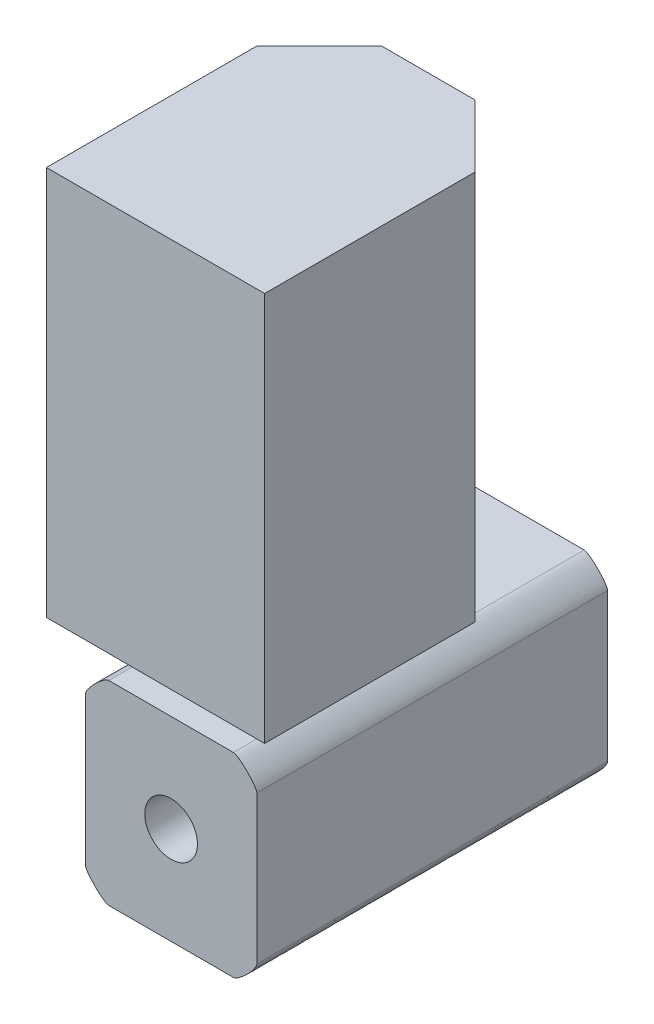
ISO-10303-21;
HEADER;
FILE_DESCRIPTION(('STEP AP214'),'2;1');
FILE_NAME('part.step','',(''),(''),'','','');
FILE_SCHEMA(('AUTOMOTIVE_DESIGN { 1 0 10303 214 1 1 1 1 }'));
ENDSEC;
DATA;
#1=APPLICATION_CONTEXT('core data for automotive mechanical design processes');
#2=APPLICATION_PROTOCOL_DEFINITION('international standard','automotive_design',2000,#1);
#3=PRODUCT_CONTEXT('',#1,'mechanical');
#4=PRODUCT('Part','Part','',(#3));
#5=PRODUCT_RELATED_PRODUCT_CATEGORY('part','',(#4));
#6=PRODUCT_DEFINITION_FORMATION('','',#4);
#7=PRODUCT_DEFINITION_CONTEXT('part definition',#1,'design');
#8=PRODUCT_DEFINITION('design','',#6,#7);
#9=PRODUCT_DEFINITION_SHAPE('','',#8);
#10=(LENGTH_UNIT() NAMED_UNIT(*) SI_UNIT(.MILLI.,.METRE.));
#11=(NAMED_UNIT(*) PLANE_ANGLE_UNIT() SI_UNIT($,.RADIAN.));
#12=(NAMED_UNIT(*) SI_UNIT($,.STERADIAN.) SOLID_ANGLE_UNIT());
#13=UNCERTAINTY_MEASURE_WITH_UNIT(LENGTH_MEASURE(1.E-05),#10,'distance_accuracy_value','');
#14=(GEOMETRIC_REPRESENTATION_CONTEXT(3) GLOBAL_UNCERTAINTY_ASSIGNED_CONTEXT((#13)) GLOBAL_UNIT_ASSIGNED_CONTEXT((#10,
#11,#12)) REPRESENTATION_CONTEXT('',''));
#15=CARTESIAN_POINT('',(0.,0.,0.));
#16=DIRECTION('',(0.,0.,1.));
#17=DIRECTION('',(1.,0.,0.));
#18=AXIS2_PLACEMENT_3D('',#15,#16,#17);
#19=CARTESIAN_POINT('',(-88.8214874697385,29.1570616468552,45.));
#20=DIRECTION('',(0.,1.,0.));
#21=DIRECTION('',(0.,0.,1.));
#22=AXIS2_PLACEMENT_3D('',#19,#20,#21);
#23=PLANE('',#22);
#24=DIRECTION('',(-0.866025403784439,0.,0.5));
#25=VECTOR('',#24,1.);
#26=CARTESIAN_POINT('',(-77.8214874697385,29.1570616468552,13.8397459621556));
#27=LINE('',#26,#25);
#28=CARTESIAN_POINT('',(-77.8214874697385,29.1570616468552,13.8397459621556));
#29=VERTEX_POINT('',#28);
#30=CARTESIAN_POINT('',(-85.3214874697385,29.1570616468552,18.1698729810778));
#31=VERTEX_POINT('',#30);
#32=EDGE_CURVE('E200',#29,#31,#27,.T.);
#33=ORIENTED_EDGE('',*,*,#32,.F.);
#34=DIRECTION('',(-0.866025403784439,0.,-0.5));
#35=VECTOR('',#34,1.);
#36=CARTESIAN_POINT('',(-70.3214874697385,29.1570616468552,18.1698729810778));
#37=LINE('',#36,#35);
#38=CARTESIAN_POINT('',(-70.3214874697385,29.1570616468552,18.1698729810778));
#39=VERTEX_POINT('',#38);
#40=EDGE_CURVE('E252',#39,#29,#37,.T.);
#41=ORIENTED_EDGE('',*,*,#40,.F.);
#42=DIRECTION('',(0.,0.,-1.));
#43=VECTOR('',#42,1.);
#44=CARTESIAN_POINT('',(-70.3214874697385,29.1570616468552,26.8301270189222));
#45=LINE('',#44,#43);
#46=CARTESIAN_POINT('',(-70.3214874697385,29.1570616468552,26.8301270189222));
#47=VERTEX_POINT('',#46);
#48=EDGE_CURVE('E279',#47,#39,#45,.T.);
#49=ORIENTED_EDGE('',*,*,#48,.F.);
#50=DIRECTION('',(0.866025403784438,0.,-0.5));
#51=VECTOR('',#50,1.);
#52=CARTESIAN_POINT('',(-77.8214874697385,29.1570616468552,31.1602540378444));
#53=LINE('',#52,#51);
#54=CARTESIAN_POINT('',(-77.8214874697385,29.1570616468552,31.1602540378444));
#55=VERTEX_POINT('',#54);
#56=EDGE_CURVE('E276',#55,#47,#53,.T.);
#57=ORIENTED_EDGE('',*,*,#56,.F.);
#58=DIRECTION('',(0.866025403784439,0.,0.5));
#59=VECTOR('',#58,1.);
#60=CARTESIAN_POINT('',(-85.3214874697385,29.1570616468552,26.8301270189222));
#61=LINE('',#60,#59);
#62=CARTESIAN_POINT('',(-85.3214874697385,29.1570616468552,26.8301270189222));
#63=VERTEX_POINT('',#62);
#64=EDGE_CURVE('E273',#63,#55,#61,.T.);
#65=ORIENTED_EDGE('',*,*,#64,.F.);
#66=DIRECTION('',(0.,0.,1.));
#67=VECTOR('',#66,1.);
#68=CARTESIAN_POINT('',(-85.3214874697385,29.1570616468552,18.1698729810778));
#69=LINE('',#68,#67);
#70=EDGE_CURVE('E270',#31,#63,#69,.T.);
#71=ORIENTED_EDGE('',*,*,#70,.F.);
#72=EDGE_LOOP('',(#33,#41,#49,#57,#65,#71));
#73=FACE_BOUND('',#72,.T.);
#74=DIRECTION('',(1.,0.,0.));
#75=VECTOR('',#74,1.);
#76=CARTESIAN_POINT('',(-88.8214874697385,29.1570616468552,0.));
#77=LINE('',#76,#75);
#78=CARTESIAN_POINT('',(-85.8214874697385,29.1570616468552,0.));
#79=VERTEX_POINT('',#78);
#80=CARTESIAN_POINT('',(-69.8214874697385,29.1570616468552,0.));
#81=VERTEX_POINT('',#80);
#82=EDGE_CURVE('E301',#79,#81,#77,.T.);
#83=ORIENTED_EDGE('',*,*,#82,.F.);
#84=CARTESIAN_POINT('',(-85.8214874697385,29.1570616468552,47.25));
#85=CARTESIAN_POINT('',(-85.8214874697385,29.1570616468552,30.75));
#86=CARTESIAN_POINT('',(-85.8214874697385,29.1570616468552,14.25));
#87=CARTESIAN_POINT('',(-85.8214874697385,29.1570616468552,-2.25));
#88=(BOUNDED_CURVE() B_SPLINE_CURVE(3,(#84,#85,#86,#87),.UNSPECIFIED.,.F.,
.F.) B_SPLINE_CURVE_WITH_KNOTS((4,4),(-0.04725,0.00225),
.UNSPECIFIED.) CURVE() GEOMETRIC_REPRESENTATION_ITEM() RATIONAL_B_SPLINE_CURVE((1.,1.,1.,1.)) REPRESENTATION_ITEM(''));
#89=CARTESIAN_POINT('',(-85.8214874697385,29.1570616468552,45.));
#90=VERTEX_POINT('',#89);
#91=EDGE_CURVE('E521',#79,#90,#88,.F.);
#92=ORIENTED_EDGE('',*,*,#91,.T.);
#93=DIRECTION('',(1.,0.,0.));
#94=VECTOR('',#93,1.);
#95=CARTESIAN_POINT('',(-88.8214874697385,29.1570616468552,45.));
#96=LINE('',#95,#94);
#97=CARTESIAN_POINT('',(-69.8214874697385,29.1570616468552,45.));
#98=VERTEX_POINT('',#97);
#99=EDGE_CURVE('E307',#90,#98,#96,.T.);
#100=ORIENTED_EDGE('',*,*,#99,.T.);
#101=CARTESIAN_POINT('',(-69.8214874697385,29.1570616468552,-2.25));
#102=CARTESIAN_POINT('',(-69.8214874697385,29.1570616468552,14.25));
#103=CARTESIAN_POINT('',(-69.8214874697385,29.1570616468552,30.75));
#104=CARTESIAN_POINT('',(-69.8214874697385,29.1570616468552,47.25));
#105=(BOUNDED_CURVE() B_SPLINE_CURVE(3,(#101,#102,#103,#104),.UNSPECIFIED.,.F.,
.F.) B_SPLINE_CURVE_WITH_KNOTS((4,4),(-0.00225,0.04725),
.UNSPECIFIED.) CURVE() GEOMETRIC_REPRESENTATION_ITEM() RATIONAL_B_SPLINE_CURVE((1.,1.,1.,1.)) REPRESENTATION_ITEM(''));
#106=EDGE_CURVE('E373',#98,#81,#105,.F.);
#107=ORIENTED_EDGE('',*,*,#106,.T.);
#108=EDGE_LOOP('',(#83,#92,#100,#107));
#109=FACE_BOUND('',#108,.T.);
#110=ADVANCED_FACE('F44',(#73,#109),#23,.T.);
#111=CARTESIAN_POINT('',(-88.8214874697385,29.1570616468552,45.));
#112=DIRECTION('',(1.,0.,0.));
#113=DIRECTION('',(0.,0.,-1.));
#114=AXIS2_PLACEMENT_3D('',#111,#112,#113);
#115=PLANE('',#114);
#116=DIRECTION('',(0.,-1.,0.));
#117=VECTOR('',#116,1.);
#118=CARTESIAN_POINT('',(-88.8214874697385,29.1570616468552,0.));
#119=LINE('',#118,#117);
#120=CARTESIAN_POINT('',(-88.8214874697385,26.1570616468552,0.));
#121=VERTEX_POINT('',#120);
#122=CARTESIAN_POINT('',(-88.8214874697385,7.15706164685515,0.));
#123=VERTEX_POINT('',#122);
#124=EDGE_CURVE('E312',#121,#123,#119,.T.);
#125=ORIENTED_EDGE('',*,*,#124,.T.);
#126=CARTESIAN_POINT('',(-88.8214874697385,7.15706164685515,47.25));
#127=CARTESIAN_POINT('',(-88.8214874697385,7.15706164685515,30.75));
#128=CARTESIAN_POINT('',(-88.8214874697385,7.15706164685515,14.25));
#129=CARTESIAN_POINT('',(-88.8214874697385,7.15706164685515,-2.25));
#130=(BOUNDED_CURVE() B_SPLINE_CURVE(3,(#126,#127,#128,#129),.UNSPECIFIED.,.F.,
.F.) B_SPLINE_CURVE_WITH_KNOTS((4,4),(-0.00225,0.04725),
.UNSPECIFIED.) CURVE() GEOMETRIC_REPRESENTATION_ITEM() RATIONAL_B_SPLINE_CURVE((1.,1.,1.,1.)) REPRESENTATION_ITEM(''));
#131=CARTESIAN_POINT('',(-88.8214874697385,7.15706164685515,45.));
#132=VERTEX_POINT('',#131);
#133=EDGE_CURVE('E462',#123,#132,#130,.F.);
#134=ORIENTED_EDGE('',*,*,#133,.T.);
#135=DIRECTION('',(0.,-1.,0.));
#136=VECTOR('',#135,1.);
#137=CARTESIAN_POINT('',(-88.8214874697385,29.1570616468552,45.));
#138=LINE('',#137,#136);
#139=CARTESIAN_POINT('',(-88.8214874697385,26.1570616468552,45.));
#140=VERTEX_POINT('',#139);
#141=EDGE_CURVE('E603',#140,#132,#138,.T.);
#142=ORIENTED_EDGE('',*,*,#141,.F.);
#143=CARTESIAN_POINT('',(-88.8214874697385,26.1570616468552,-2.25));
#144=CARTESIAN_POINT('',(-88.8214874697385,26.1570616468552,14.25));
#145=CARTESIAN_POINT('',(-88.8214874697385,26.1570616468552,30.75));
#146=CARTESIAN_POINT('',(-88.8214874697385,26.1570616468552,47.25));
#147=(BOUNDED_CURVE() B_SPLINE_CURVE(3,(#143,#144,#145,#146),.UNSPECIFIED.,.F.,
.F.) B_SPLINE_CURVE_WITH_KNOTS((4,4),(-0.04725,0.00225),
.UNSPECIFIED.) CURVE() GEOMETRIC_REPRESENTATION_ITEM() RATIONAL_B_SPLINE_CURVE((1.,1.,1.,1.)) REPRESENTATION_ITEM(''));
#148=EDGE_CURVE('E661',#140,#121,#147,.F.);
#149=ORIENTED_EDGE('',*,*,#148,.T.);
#150=EDGE_LOOP('',(#125,#134,#142,#149));
#151=FACE_BOUND('',#150,.T.);
#152=ADVANCED_FACE('F389',(#151),#115,.F.);
#153=CARTESIAN_POINT('',(-88.8214874697385,4.15706164685515,45.));
#154=DIRECTION('',(0.,1.,0.));
#155=DIRECTION('',(-1.,0.,0.));
#156=AXIS2_PLACEMENT_3D('',#153,#154,#155);
#157=PLANE('',#156);
#158=DIRECTION('',(1.,0.,0.));
#159=VECTOR('',#158,1.);
#160=CARTESIAN_POINT('',(-88.8214874697385,4.15706164685515,45.));
#161=LINE('',#160,#159);
#162=CARTESIAN_POINT('',(-85.8214874697385,4.15706164685515,45.));
#163=VERTEX_POINT('',#162);
#164=CARTESIAN_POINT('',(-69.8214874697385,4.15706164685515,45.));
#165=VERTEX_POINT('',#164);
#166=EDGE_CURVE('E317',#163,#165,#161,.T.);
#167=ORIENTED_EDGE('',*,*,#166,.F.);
#168=CARTESIAN_POINT('',(-85.8214874697385,4.15706164685515,-2.25));
#169=CARTESIAN_POINT('',(-85.8214874697385,4.15706164685515,14.25));
#170=CARTESIAN_POINT('',(-85.8214874697385,4.15706164685515,30.75));
#171=CARTESIAN_POINT('',(-85.8214874697385,4.15706164685515,47.25));
#172=(BOUNDED_CURVE() B_SPLINE_CURVE(3,(#168,#169,#170,#171),.UNSPECIFIED.,.F.,
.F.) B_SPLINE_CURVE_WITH_KNOTS((4,4),(-0.00225,0.04725),
.UNSPECIFIED.) CURVE() GEOMETRIC_REPRESENTATION_ITEM() RATIONAL_B_SPLINE_CURVE((1.,1.,1.,1.)) REPRESENTATION_ITEM(''));
#173=CARTESIAN_POINT('',(-85.8214874697385,4.15706164685515,0.));
#174=VERTEX_POINT('',#173);
#175=EDGE_CURVE('E443',#163,#174,#172,.F.);
#176=ORIENTED_EDGE('',*,*,#175,.T.);
#177=DIRECTION('',(1.,0.,0.));
#178=VECTOR('',#177,1.);
#179=CARTESIAN_POINT('',(-88.8214874697385,4.15706164685515,0.));
#180=LINE('',#179,#178);
#181=CARTESIAN_POINT('',(-69.8214874697385,4.15706164685515,0.));
#182=VERTEX_POINT('',#181);
#183=EDGE_CURVE('E629',#174,#182,#180,.T.);
#184=ORIENTED_EDGE('',*,*,#183,.T.);
#185=CARTESIAN_POINT('',(-69.8214874697385,4.15706164685515,47.25));
#186=CARTESIAN_POINT('',(-69.8214874697385,4.15706164685515,30.75));
#187=CARTESIAN_POINT('',(-69.8214874697385,4.15706164685515,14.25));
#188=CARTESIAN_POINT('',(-69.8214874697385,4.15706164685515,-2.25));
#189=(BOUNDED_CURVE() B_SPLINE_CURVE(3,(#185,#186,#187,#188),.UNSPECIFIED.,.F.,
.F.) B_SPLINE_CURVE_WITH_KNOTS((4,4),(-0.04725,0.00225),
.UNSPECIFIED.) CURVE() GEOMETRIC_REPRESENTATION_ITEM() RATIONAL_B_SPLINE_CURVE((1.,1.,1.,1.)) REPRESENTATION_ITEM(''));
#190=EDGE_CURVE('E599',#182,#165,#189,.F.);
#191=ORIENTED_EDGE('',*,*,#190,.T.);
#192=EDGE_LOOP('',(#167,#176,#184,#191));
#193=FACE_BOUND('',#192,.T.);
#194=ADVANCED_FACE('F640',(#193),#157,.F.);
#195=CARTESIAN_POINT('',(-66.8214874697385,29.1570616468552,45.));
#196=DIRECTION('',(1.,0.,0.));
#197=DIRECTION('',(0.,0.,-1.));
#198=AXIS2_PLACEMENT_3D('',#195,#196,#197);
#199=PLANE('',#198);
#200=DIRECTION('',(0.,-1.,0.));
#201=VECTOR('',#200,1.);
#202=CARTESIAN_POINT('',(-66.8214874697385,29.1570616468552,0.));
#203=LINE('',#202,#201);
#204=CARTESIAN_POINT('',(-66.8214874697385,26.1570616468552,0.));
#205=VERTEX_POINT('',#204);
#206=CARTESIAN_POINT('',(-66.8214874697385,7.15706164685515,0.));
#207=VERTEX_POINT('',#206);
#208=EDGE_CURVE('E624',#205,#207,#203,.T.);
#209=ORIENTED_EDGE('',*,*,#208,.F.);
#210=CARTESIAN_POINT('',(-66.8214874697385,26.1570616468552,47.25));
#211=CARTESIAN_POINT('',(-66.8214874697385,26.1570616468552,30.75));
#212=CARTESIAN_POINT('',(-66.8214874697385,26.1570616468552,14.25));
#213=CARTESIAN_POINT('',(-66.8214874697385,26.1570616468552,-2.25));
#214=(BOUNDED_CURVE() B_SPLINE_CURVE(3,(#210,#211,#212,#213),.UNSPECIFIED.,.F.,
.F.) B_SPLINE_CURVE_WITH_KNOTS((4,4),(-0.00225,0.04725),
.UNSPECIFIED.) CURVE() GEOMETRIC_REPRESENTATION_ITEM() RATIONAL_B_SPLINE_CURVE((1.,1.,1.,1.)) REPRESENTATION_ITEM(''));
#215=CARTESIAN_POINT('',(-66.8214874697385,26.1570616468552,45.));
#216=VERTEX_POINT('',#215);
#217=EDGE_CURVE('E12',#205,#216,#214,.F.);
#218=ORIENTED_EDGE('',*,*,#217,.T.);
#219=DIRECTION('',(0.,-1.,0.));
#220=VECTOR('',#219,1.);
#221=CARTESIAN_POINT('',(-66.8214874697385,29.1570616468552,45.));
#222=LINE('',#221,#220);
#223=CARTESIAN_POINT('',(-66.8214874697385,7.15706164685515,45.));
#224=VERTEX_POINT('',#223);
#225=EDGE_CURVE('E311',#216,#224,#222,.T.);
#226=ORIENTED_EDGE('',*,*,#225,.T.);
#227=CARTESIAN_POINT('',(-66.8214874697385,7.15706164685515,-2.25));
#228=CARTESIAN_POINT('',(-66.8214874697385,7.15706164685515,14.25));
#229=CARTESIAN_POINT('',(-66.8214874697385,7.15706164685515,30.75));
#230=CARTESIAN_POINT('',(-66.8214874697385,7.15706164685515,47.25));
#231=(BOUNDED_CURVE() B_SPLINE_CURVE(3,(#227,#228,#229,#230),.UNSPECIFIED.,.F.,
.F.) B_SPLINE_CURVE_WITH_KNOTS((4,4),(-0.04725,0.00225),
.UNSPECIFIED.) CURVE() GEOMETRIC_REPRESENTATION_ITEM() RATIONAL_B_SPLINE_CURVE((1.,1.,1.,1.)) REPRESENTATION_ITEM(''));
#232=EDGE_CURVE('E58',#224,#207,#231,.F.);
#233=ORIENTED_EDGE('',*,*,#232,.T.);
#234=EDGE_LOOP('',(#209,#218,#226,#233));
#235=FACE_BOUND('',#234,.T.);
#236=ADVANCED_FACE('F335',(#235),#199,.T.);
#237=CARTESIAN_POINT('',(0.,0.,45.));
#238=DIRECTION('',(0.,0.,-1.));
#239=DIRECTION('',(-1.,0.,0.));
#240=AXIS2_PLACEMENT_3D('',#237,#238,#239);
#241=PLANE('',#240);
#242=CARTESIAN_POINT('',(-77.8214874697385,16.6570616468552,45.));
#243=DIRECTION('',(0.,0.,-1.));
#244=DIRECTION('',(-1.,0.,0.));
#245=AXIS2_PLACEMENT_3D('',#242,#243,#244);
#246=CIRCLE('',#245,3.37819999999998);
#247=CARTESIAN_POINT('',(-81.1996874697385,16.6570616468552,45.));
#248=VERTEX_POINT('',#247);
#249=EDGE_CURVE('E227',#248,#248,#246,.T.);
#250=ORIENTED_EDGE('',*,*,#249,.T.);
#251=EDGE_LOOP('',(#250));
#252=FACE_BOUND('',#251,.T.);
#253=ORIENTED_EDGE('',*,*,#141,.T.);
#254=CARTESIAN_POINT('',(-85.8214874697385,4.15706164685515,45.));
#255=CARTESIAN_POINT('',(-88.8214874697385,4.15706164685516,45.));
#256=CARTESIAN_POINT('',(-88.8214874697385,7.15706164685515,45.));
#257=(BOUNDED_CURVE() B_SPLINE_CURVE(2,(#254,#255,#256),.UNSPECIFIED.,.F.,
.F.) B_SPLINE_CURVE_WITH_KNOTS((3,3),(0.,1.),
.UNSPECIFIED.) CURVE() GEOMETRIC_REPRESENTATION_ITEM() RATIONAL_B_SPLINE_CURVE((1.,
0.212132034355965,1.)) REPRESENTATION_ITEM(''));
#258=EDGE_CURVE('E358',#132,#163,#257,.F.);
#259=ORIENTED_EDGE('',*,*,#258,.T.);
#260=ORIENTED_EDGE('',*,*,#166,.T.);
#261=CARTESIAN_POINT('',(-66.8214874697385,7.15706164685515,45.));
#262=CARTESIAN_POINT('',(-66.8214874697385,4.15706164685515,45.));
#263=CARTESIAN_POINT('',(-69.8214874697385,4.15706164685515,45.));
#264=(BOUNDED_CURVE() B_SPLINE_CURVE(2,(#261,#262,#263),.UNSPECIFIED.,.F.,
.F.) B_SPLINE_CURVE_WITH_KNOTS((3,3),(0.,1.),
.UNSPECIFIED.) CURVE() GEOMETRIC_REPRESENTATION_ITEM() RATIONAL_B_SPLINE_CURVE((1.,
0.212132034355964,1.)) REPRESENTATION_ITEM(''));
#265=EDGE_CURVE('E65',#165,#224,#264,.F.);
#266=ORIENTED_EDGE('',*,*,#265,.T.);
#267=ORIENTED_EDGE('',*,*,#225,.F.);
#268=CARTESIAN_POINT('',(-69.8214874697385,29.1570616468552,45.));
#269=CARTESIAN_POINT('',(-66.8214874697385,29.1570616468552,45.));
#270=CARTESIAN_POINT('',(-66.8214874697385,26.1570616468552,45.));
#271=(BOUNDED_CURVE() B_SPLINE_CURVE(2,(#268,#269,#270),.UNSPECIFIED.,.F.,
.F.) B_SPLINE_CURVE_WITH_KNOTS((3,3),(0.,1.),
.UNSPECIFIED.) CURVE() GEOMETRIC_REPRESENTATION_ITEM() RATIONAL_B_SPLINE_CURVE((1.,
0.212132034355964,1.)) REPRESENTATION_ITEM(''));
#272=EDGE_CURVE('E552',#216,#98,#271,.F.);
#273=ORIENTED_EDGE('',*,*,#272,.T.);
#274=ORIENTED_EDGE('',*,*,#99,.F.);
#275=CARTESIAN_POINT('',(-88.8214874697385,26.1570616468552,45.));
#276=CARTESIAN_POINT('',(-88.8214874697385,29.1570616468551,45.));
#277=CARTESIAN_POINT('',(-85.8214874697385,29.1570616468552,45.));
#278=(BOUNDED_CURVE() B_SPLINE_CURVE(2,(#275,#276,#277),.UNSPECIFIED.,.F.,
.F.) B_SPLINE_CURVE_WITH_KNOTS((3,3),(0.,1.),
.UNSPECIFIED.) CURVE() GEOMETRIC_REPRESENTATION_ITEM() RATIONAL_B_SPLINE_CURVE((1.,
0.212132034355965,1.)) REPRESENTATION_ITEM(''));
#279=EDGE_CURVE('E914',#90,#140,#278,.F.);
#280=ORIENTED_EDGE('',*,*,#279,.T.);
#281=EDGE_LOOP('',(#253,#259,#260,#266,#267,#273,#274,#280));
#282=FACE_BOUND('',#281,.T.);
#283=ADVANCED_FACE('F324',(#252,#282),#241,.F.);
#284=CARTESIAN_POINT('',(0.,0.,0.));
#285=DIRECTION('',(0.,0.,-1.));
#286=DIRECTION('',(-1.,0.,0.));
#287=AXIS2_PLACEMENT_3D('',#284,#285,#286);
#288=PLANE('',#287);
#289=CARTESIAN_POINT('',(-77.8214874697385,16.6570616468552,0.));
#290=DIRECTION('',(0.,0.,-1.));
#291=DIRECTION('',(-1.,0.,0.));
#292=AXIS2_PLACEMENT_3D('',#289,#290,#291);
#293=CIRCLE('',#292,4.01319999999999);
#294=CARTESIAN_POINT('',(-81.8346874697385,16.6570616468552,0.));
#295=VERTEX_POINT('',#294);
#296=EDGE_CURVE('E892',#295,#295,#293,.T.);
#297=ORIENTED_EDGE('',*,*,#296,.F.);
#298=EDGE_LOOP('',(#297));
#299=FACE_BOUND('',#298,.T.);
#300=ORIENTED_EDGE('',*,*,#183,.F.);
#301=CARTESIAN_POINT('',(-88.8214874697385,7.15706164685515,0.));
#302=CARTESIAN_POINT('',(-88.8214874697385,4.15706164685516,0.));
#303=CARTESIAN_POINT('',(-85.8214874697385,4.15706164685515,0.));
#304=(BOUNDED_CURVE() B_SPLINE_CURVE(2,(#301,#302,#303),.UNSPECIFIED.,.F.,
.F.) B_SPLINE_CURVE_WITH_KNOTS((3,3),(0.,1.),
.UNSPECIFIED.) CURVE() GEOMETRIC_REPRESENTATION_ITEM() RATIONAL_B_SPLINE_CURVE((1.,
0.212132034355965,1.)) REPRESENTATION_ITEM(''));
#305=EDGE_CURVE('E432',#174,#123,#304,.F.);
#306=ORIENTED_EDGE('',*,*,#305,.T.);
#307=ORIENTED_EDGE('',*,*,#124,.F.);
#308=CARTESIAN_POINT('',(-85.8214874697385,29.1570616468552,0.));
#309=CARTESIAN_POINT('',(-88.8214874697385,29.1570616468551,0.));
#310=CARTESIAN_POINT('',(-88.8214874697385,26.1570616468552,0.));
#311=(BOUNDED_CURVE() B_SPLINE_CURVE(2,(#308,#309,#310),.UNSPECIFIED.,.F.,
.F.) B_SPLINE_CURVE_WITH_KNOTS((3,3),(0.,1.),
.UNSPECIFIED.) CURVE() GEOMETRIC_REPRESENTATION_ITEM() RATIONAL_B_SPLINE_CURVE((1.,
0.212132034355965,1.)) REPRESENTATION_ITEM(''));
#312=EDGE_CURVE('E475',#121,#79,#311,.F.);
#313=ORIENTED_EDGE('',*,*,#312,.T.);
#314=ORIENTED_EDGE('',*,*,#82,.T.);
#315=CARTESIAN_POINT('',(-66.8214874697385,26.1570616468552,0.));
#316=CARTESIAN_POINT('',(-66.8214874697385,29.1570616468552,0.));
#317=CARTESIAN_POINT('',(-69.8214874697385,29.1570616468552,0.));
#318=(BOUNDED_CURVE() B_SPLINE_CURVE(2,(#315,#316,#317),.UNSPECIFIED.,.F.,
.F.) B_SPLINE_CURVE_WITH_KNOTS((3,3),(0.,1.),
.UNSPECIFIED.) CURVE() GEOMETRIC_REPRESENTATION_ITEM() RATIONAL_B_SPLINE_CURVE((1.,
0.212132034355964,1.)) REPRESENTATION_ITEM(''));
#319=EDGE_CURVE('E532',#81,#205,#318,.F.);
#320=ORIENTED_EDGE('',*,*,#319,.T.);
#321=ORIENTED_EDGE('',*,*,#208,.T.);
#322=CARTESIAN_POINT('',(-69.8214874697385,4.15706164685515,0.));
#323=CARTESIAN_POINT('',(-66.8214874697385,4.15706164685515,0.));
#324=CARTESIAN_POINT('',(-66.8214874697385,7.15706164685515,0.));
#325=(BOUNDED_CURVE() B_SPLINE_CURVE(2,(#322,#323,#324),.UNSPECIFIED.,.F.,
.F.) B_SPLINE_CURVE_WITH_KNOTS((3,3),(0.,1.),
.UNSPECIFIED.) CURVE() GEOMETRIC_REPRESENTATION_ITEM() RATIONAL_B_SPLINE_CURVE((1.,
0.212132034355964,1.)) REPRESENTATION_ITEM(''));
#326=EDGE_CURVE('E573',#207,#182,#325,.F.);
#327=ORIENTED_EDGE('',*,*,#326,.T.);
#328=EDGE_LOOP('',(#300,#306,#307,#313,#314,#320,#321,#327));
#329=FACE_BOUND('',#328,.T.);
#330=ADVANCED_FACE('F334',(#299,#329),#288,.T.);
#331=CARTESIAN_POINT('',(-77.8214874697385,34.1570616468551,13.8397459621556));
#332=DIRECTION('',(0.5,0.,0.866025403784439));
#333=DIRECTION('',(0.866025403784439,0.,-0.5));
#334=AXIS2_PLACEMENT_3D('',#331,#332,#333);
#335=PLANE('',#334);
#336=ORIENTED_EDGE('',*,*,#32,.T.);
#337=DIRECTION('',(0.,-1.,0.));
#338=VECTOR('',#337,1.);
#339=CARTESIAN_POINT('',(-85.3214874697385,34.1570616468551,18.1698729810778));
#340=LINE('',#339,#338);
#341=CARTESIAN_POINT('',(-85.3214874697385,34.1570616468551,18.1698729810778));
#342=VERTEX_POINT('',#341);
#343=EDGE_CURVE('E298',#342,#31,#340,.T.);
#344=ORIENTED_EDGE('',*,*,#343,.F.);
#345=DIRECTION('',(-0.866025403784439,0.,0.5));
#346=VECTOR('',#345,1.);
#347=CARTESIAN_POINT('',(-77.8214874697385,34.1570616468551,13.8397459621556));
#348=LINE('',#347,#346);
#349=CARTESIAN_POINT('',(-77.8214874697385,34.1570616468551,13.8397459621556));
#350=VERTEX_POINT('',#349);
#351=EDGE_CURVE('E248',#350,#342,#348,.T.);
#352=ORIENTED_EDGE('',*,*,#351,.F.);
#353=DIRECTION('',(0.,-1.,0.));
#354=VECTOR('',#353,1.);
#355=CARTESIAN_POINT('',(-77.8214874697385,34.1570616468551,13.8397459621556));
#356=LINE('',#355,#354);
#357=EDGE_CURVE('E267',#350,#29,#356,.T.);
#358=ORIENTED_EDGE('',*,*,#357,.T.);
#359=EDGE_LOOP('',(#336,#344,#352,#358));
#360=FACE_BOUND('',#359,.T.);
#361=ADVANCED_FACE('F337',(#360),#335,.F.);
#362=CARTESIAN_POINT('',(-85.3214874697385,34.1570616468551,18.1698729810778));
#363=DIRECTION('',(1.,0.,0.));
#364=DIRECTION('',(0.,0.,-1.));
#365=AXIS2_PLACEMENT_3D('',#362,#363,#364);
#366=PLANE('',#365);
#367=ORIENTED_EDGE('',*,*,#70,.T.);
#368=DIRECTION('',(0.,-1.,0.));
#369=VECTOR('',#368,1.);
#370=CARTESIAN_POINT('',(-85.3214874697385,34.1570616468551,26.8301270189222));
#371=LINE('',#370,#369);
#372=CARTESIAN_POINT('',(-85.3214874697385,34.1570616468551,26.8301270189222));
#373=VERTEX_POINT('',#372);
#374=EDGE_CURVE('E295',#373,#63,#371,.T.);
#375=ORIENTED_EDGE('',*,*,#374,.F.);
#376=DIRECTION('',(0.,0.,1.));
#377=VECTOR('',#376,1.);
#378=CARTESIAN_POINT('',(-85.3214874697385,34.1570616468551,18.1698729810778));
#379=LINE('',#378,#377);
#380=EDGE_CURVE('E251',#342,#373,#379,.T.);
#381=ORIENTED_EDGE('',*,*,#380,.F.);
#382=ORIENTED_EDGE('',*,*,#343,.T.);
#383=EDGE_LOOP('',(#367,#375,#381,#382));
#384=FACE_BOUND('',#383,.T.);
#385=ADVANCED_FACE('F688',(#384),#366,.F.);
#386=CARTESIAN_POINT('',(-85.3214874697385,34.1570616468551,26.8301270189222));
#387=DIRECTION('',(0.5,0.,-0.866025403784439));
#388=DIRECTION('',(-0.866025403784439,0.,-0.5));
#389=AXIS2_PLACEMENT_3D('',#386,#387,#388);
#390=PLANE('',#389);
#391=ORIENTED_EDGE('',*,*,#64,.T.);
#392=DIRECTION('',(0.,-1.,0.));
#393=VECTOR('',#392,1.);
#394=CARTESIAN_POINT('',(-77.8214874697385,34.1570616468551,31.1602540378444));
#395=LINE('',#394,#393);
#396=CARTESIAN_POINT('',(-77.8214874697385,34.1570616468551,31.1602540378444));
#397=VERTEX_POINT('',#396);
#398=EDGE_CURVE('E292',#397,#55,#395,.T.);
#399=ORIENTED_EDGE('',*,*,#398,.F.);
#400=DIRECTION('',(0.866025403784439,0.,0.5));
#401=VECTOR('',#400,1.);
#402=CARTESIAN_POINT('',(-85.3214874697385,34.1570616468551,26.8301270189222));
#403=LINE('',#402,#401);
#404=EDGE_CURVE('E255',#373,#397,#403,.T.);
#405=ORIENTED_EDGE('',*,*,#404,.F.);
#406=ORIENTED_EDGE('',*,*,#374,.T.);
#407=EDGE_LOOP('',(#391,#399,#405,#406));
#408=FACE_BOUND('',#407,.T.);
#409=ADVANCED_FACE('F695',(#408),#390,.F.);
#410=CARTESIAN_POINT('',(-77.8214874697385,34.1570616468551,31.1602540378444));
#411=DIRECTION('',(-0.5,0.,-0.866025403784439));
#412=DIRECTION('',(-0.866025403784439,0.,0.5));
#413=AXIS2_PLACEMENT_3D('',#410,#411,#412);
#414=PLANE('',#413);
#415=ORIENTED_EDGE('',*,*,#56,.T.);
#416=DIRECTION('',(0.,-1.,0.));
#417=VECTOR('',#416,1.);
#418=CARTESIAN_POINT('',(-70.3214874697385,34.1570616468551,26.8301270189222));
#419=LINE('',#418,#417);
#420=CARTESIAN_POINT('',(-70.3214874697385,34.1570616468551,26.8301270189222));
#421=VERTEX_POINT('',#420);
#422=EDGE_CURVE('E289',#421,#47,#419,.T.);
#423=ORIENTED_EDGE('',*,*,#422,.F.);
#424=DIRECTION('',(0.866025403784438,0.,-0.5));
#425=VECTOR('',#424,1.);
#426=CARTESIAN_POINT('',(-77.8214874697385,34.1570616468551,31.1602540378444));
#427=LINE('',#426,#425);
#428=EDGE_CURVE('E258',#397,#421,#427,.T.);
#429=ORIENTED_EDGE('',*,*,#428,.F.);
#430=ORIENTED_EDGE('',*,*,#398,.T.);
#431=EDGE_LOOP('',(#415,#423,#429,#430));
#432=FACE_BOUND('',#431,.T.);
#433=ADVANCED_FACE('F702',(#432),#414,.F.);
#434=CARTESIAN_POINT('',(-70.3214874697385,34.1570616468551,26.8301270189222));
#435=DIRECTION('',(-1.,0.,0.));
#436=DIRECTION('',(0.,0.,1.));
#437=AXIS2_PLACEMENT_3D('',#434,#435,#436);
#438=PLANE('',#437);
#439=ORIENTED_EDGE('',*,*,#48,.T.);
#440=DIRECTION('',(0.,-1.,0.));
#441=VECTOR('',#440,1.);
#442=CARTESIAN_POINT('',(-70.3214874697385,34.1570616468551,18.1698729810778));
#443=LINE('',#442,#441);
#444=CARTESIAN_POINT('',(-70.3214874697385,34.1570616468551,18.1698729810778));
#445=VERTEX_POINT('',#444);
#446=EDGE_CURVE('E286',#445,#39,#443,.T.);
#447=ORIENTED_EDGE('',*,*,#446,.F.);
#448=DIRECTION('',(0.,0.,-1.));
#449=VECTOR('',#448,1.);
#450=CARTESIAN_POINT('',(-70.3214874697385,34.1570616468551,26.8301270189222));
#451=LINE('',#450,#449);
#452=EDGE_CURVE('E261',#421,#445,#451,.T.);
#453=ORIENTED_EDGE('',*,*,#452,.F.);
#454=ORIENTED_EDGE('',*,*,#422,.T.);
#455=EDGE_LOOP('',(#439,#447,#453,#454));
#456=FACE_BOUND('',#455,.T.);
#457=ADVANCED_FACE('F710',(#456),#438,.F.);
#458=CARTESIAN_POINT('',(-70.3214874697385,34.1570616468551,18.1698729810778));
#459=DIRECTION('',(-0.5,0.,0.866025403784439));
#460=DIRECTION('',(0.866025403784439,0.,0.5));
#461=AXIS2_PLACEMENT_3D('',#458,#459,#460);
#462=PLANE('',#461);
#463=ORIENTED_EDGE('',*,*,#40,.T.);
#464=ORIENTED_EDGE('',*,*,#357,.F.);
#465=DIRECTION('',(-0.866025403784439,0.,-0.5));
#466=VECTOR('',#465,1.);
#467=CARTESIAN_POINT('',(-70.3214874697385,34.1570616468551,18.1698729810778));
#468=LINE('',#467,#466);
#469=EDGE_CURVE('E264',#445,#350,#468,.T.);
#470=ORIENTED_EDGE('',*,*,#469,.F.);
#471=ORIENTED_EDGE('',*,*,#446,.T.);
#472=EDGE_LOOP('',(#463,#464,#470,#471));
#473=FACE_BOUND('',#472,.T.);
#474=ADVANCED_FACE('F718',(#473),#462,.F.);
#475=CARTESIAN_POINT('',(0.,34.1570616468551,0.));
#476=DIRECTION('',(0.,1.,0.));
#477=DIRECTION('',(0.,0.,1.));
#478=AXIS2_PLACEMENT_3D('',#475,#476,#477);
#479=PLANE('',#478);
#480=DIRECTION('',(0.707106781186548,0.,0.707106781186547));
#481=VECTOR('',#480,1.);
#482=CARTESIAN_POINT('',(-41.9107437348692,34.1570616468551,41.9107437348692));
#483=LINE('',#482,#481);
#484=CARTESIAN_POINT('',(-71.8214874697385,34.1570616468551,12.));
#485=VERTEX_POINT('',#484);
#486=CARTESIAN_POINT('',(-63.8214874697385,34.1570616468551,20.));
#487=VERTEX_POINT('',#486);
#488=EDGE_CURVE('E195',#485,#487,#483,.T.);
#489=ORIENTED_EDGE('',*,*,#488,.T.);
#490=DIRECTION('',(0.,0.,1.));
#491=VECTOR('',#490,1.);
#492=CARTESIAN_POINT('',(-63.8214874697385,34.1570616468551,0.));
#493=LINE('',#492,#491);
#494=CARTESIAN_POINT('',(-63.8214874697385,34.1570616468551,47.));
#495=VERTEX_POINT('',#494);
#496=EDGE_CURVE('E211',#487,#495,#493,.T.);
#497=ORIENTED_EDGE('',*,*,#496,.T.);
#498=DIRECTION('',(1.,0.,0.));
#499=VECTOR('',#498,1.);
#500=CARTESIAN_POINT('',(0.,34.1570616468551,47.));
#501=LINE('',#500,#499);
#502=CARTESIAN_POINT('',(-91.8214874697385,34.1570616468551,47.));
#503=VERTEX_POINT('',#502);
#504=EDGE_CURVE('E234',#503,#495,#501,.T.);
#505=ORIENTED_EDGE('',*,*,#504,.F.);
#506=DIRECTION('',(0.,0.,1.));
#507=VECTOR('',#506,1.);
#508=CARTESIAN_POINT('',(-91.8214874697385,34.1570616468551,0.));
#509=LINE('',#508,#507);
#510=CARTESIAN_POINT('',(-91.8214874697385,34.1570616468551,20.));
#511=VERTEX_POINT('',#510);
#512=EDGE_CURVE('E232',#511,#503,#509,.T.);
#513=ORIENTED_EDGE('',*,*,#512,.F.);
#514=DIRECTION('',(0.707106781186548,0.,-0.707106781186547));
#515=VECTOR('',#514,1.);
#516=CARTESIAN_POINT('',(-35.9107437348692,34.1570616468551,-35.9107437348692));
#517=LINE('',#516,#515);
#518=CARTESIAN_POINT('',(-83.8214874697385,34.1570616468551,12.));
#519=VERTEX_POINT('',#518);
#520=EDGE_CURVE('E229',#511,#519,#517,.T.);
#521=ORIENTED_EDGE('',*,*,#520,.T.);
#522=DIRECTION('',(1.,0.,0.));
#523=VECTOR('',#522,1.);
#524=CARTESIAN_POINT('',(0.,34.1570616468551,12.));
#525=LINE('',#524,#523);
#526=EDGE_CURVE('E226',#519,#485,#525,.T.);
#527=ORIENTED_EDGE('',*,*,#526,.T.);
#528=EDGE_LOOP('',(#489,#497,#505,#513,#521,#527));
#529=FACE_BOUND('',#528,.T.);
#530=ORIENTED_EDGE('',*,*,#469,.T.);
#531=ORIENTED_EDGE('',*,*,#351,.T.);
#532=ORIENTED_EDGE('',*,*,#380,.T.);
#533=ORIENTED_EDGE('',*,*,#404,.T.);
#534=ORIENTED_EDGE('',*,*,#428,.T.);
#535=ORIENTED_EDGE('',*,*,#452,.T.);
#536=EDGE_LOOP('',(#530,#531,#532,#533,#534,#535));
#537=FACE_BOUND('',#536,.T.);
#538=ADVANCED_FACE('F726',(#529,#537),#479,.F.);
#539=CARTESIAN_POINT('',(-41.9107437348692,84.1570616468552,41.9107437348692));
#540=DIRECTION('',(0.707106781186547,0.,-0.707106781186548));
#541=DIRECTION('',(-0.707106781186548,0.,-0.707106781186547));
#542=AXIS2_PLACEMENT_3D('',#539,#540,#541);
#543=PLANE('',#542);
#544=ORIENTED_EDGE('',*,*,#488,.F.);
#545=DIRECTION('',(0.,-1.,0.));
#546=VECTOR('',#545,1.);
#547=CARTESIAN_POINT('',(-71.8214874697385,84.1570616468552,12.));
#548=LINE('',#547,#546);
#549=CARTESIAN_POINT('',(-71.8214874697385,84.1570616468552,12.));
#550=VERTEX_POINT('',#549);
#551=EDGE_CURVE('E189',#550,#485,#548,.T.);
#552=ORIENTED_EDGE('',*,*,#551,.F.);
#553=DIRECTION('',(0.707106781186548,0.,0.707106781186547));
#554=VECTOR('',#553,1.);
#555=CARTESIAN_POINT('',(-41.9107437348692,84.1570616468552,41.9107437348692));
#556=LINE('',#555,#554);
#557=CARTESIAN_POINT('',(-63.8214874697385,84.1570616468552,20.));
#558=VERTEX_POINT('',#557);
#559=EDGE_CURVE('E192',#550,#558,#556,.T.);
#560=ORIENTED_EDGE('',*,*,#559,.T.);
#561=DIRECTION('',(0.,-1.,0.));
#562=VECTOR('',#561,1.);
#563=CARTESIAN_POINT('',(-63.8214874697385,84.1570616468552,20.));
#564=LINE('',#563,#562);
#565=EDGE_CURVE('E224',#558,#487,#564,.T.);
#566=ORIENTED_EDGE('',*,*,#565,.T.);
#567=EDGE_LOOP('',(#544,#552,#560,#566));
#568=FACE_BOUND('',#567,.T.);
#569=ADVANCED_FACE('F191',(#568),#543,.T.);
#570=CARTESIAN_POINT('',(0.,84.1570616468552,12.));
#571=DIRECTION('',(0.,0.,-1.));
#572=DIRECTION('',(-1.,0.,0.));
#573=AXIS2_PLACEMENT_3D('',#570,#571,#572);
#574=PLANE('',#573);
#575=ORIENTED_EDGE('',*,*,#526,.F.);
#576=DIRECTION('',(0.,-1.,0.));
#577=VECTOR('',#576,1.);
#578=CARTESIAN_POINT('',(-83.8214874697385,84.1570616468552,12.));
#579=LINE('',#578,#577);
#580=CARTESIAN_POINT('',(-83.8214874697385,84.1570616468552,12.));
#581=VERTEX_POINT('',#580);
#582=EDGE_CURVE('E201',#581,#519,#579,.T.);
#583=ORIENTED_EDGE('',*,*,#582,.F.);
#584=DIRECTION('',(1.,0.,0.));
#585=VECTOR('',#584,1.);
#586=CARTESIAN_POINT('',(0.,84.1570616468552,12.));
#587=LINE('',#586,#585);
#588=EDGE_CURVE('E207',#581,#550,#587,.T.);
#589=ORIENTED_EDGE('',*,*,#588,.T.);
#590=ORIENTED_EDGE('',*,*,#551,.T.);
#591=EDGE_LOOP('',(#575,#583,#589,#590));
#592=FACE_BOUND('',#591,.T.);
#593=ADVANCED_FACE('F213',(#592),#574,.T.);
#594=CARTESIAN_POINT('',(-35.9107437348692,84.1570616468552,-35.9107437348692));
#595=DIRECTION('',(-0.707106781186547,0.,-0.707106781186548));
#596=DIRECTION('',(-0.707106781186548,0.,0.707106781186547));
#597=AXIS2_PLACEMENT_3D('',#594,#595,#596);
#598=PLANE('',#597);
#599=ORIENTED_EDGE('',*,*,#520,.F.);
#600=DIRECTION('',(0.,-1.,0.));
#601=VECTOR('',#600,1.);
#602=CARTESIAN_POINT('',(-91.8214874697385,84.1570616468552,20.));
#603=LINE('',#602,#601);
#604=CARTESIAN_POINT('',(-91.8214874697385,84.1570616468552,20.));
#605=VERTEX_POINT('',#604);
#606=EDGE_CURVE('E245',#605,#511,#603,.T.);
#607=ORIENTED_EDGE('',*,*,#606,.F.);
#608=DIRECTION('',(0.707106781186548,0.,-0.707106781186547));
#609=VECTOR('',#608,1.);
#610=CARTESIAN_POINT('',(-35.9107437348692,84.1570616468552,-35.9107437348692));
#611=LINE('',#610,#609);
#612=EDGE_CURVE('E214',#605,#581,#611,.T.);
#613=ORIENTED_EDGE('',*,*,#612,.T.);
#614=ORIENTED_EDGE('',*,*,#582,.T.);
#615=EDGE_LOOP('',(#599,#607,#613,#614));
#616=FACE_BOUND('',#615,.T.);
#617=ADVANCED_FACE('F747',(#616),#598,.T.);
#618=CARTESIAN_POINT('',(-91.8214874697385,84.1570616468552,0.));
#619=DIRECTION('',(1.,0.,0.));
#620=DIRECTION('',(0.,0.,-1.));
#621=AXIS2_PLACEMENT_3D('',#618,#619,#620);
#622=PLANE('',#621);
#623=ORIENTED_EDGE('',*,*,#512,.T.);
#624=DIRECTION('',(0.,-1.,0.));
#625=VECTOR('',#624,1.);
#626=CARTESIAN_POINT('',(-91.8214874697385,84.1570616468552,47.));
#627=LINE('',#626,#625);
#628=CARTESIAN_POINT('',(-91.8214874697385,84.1570616468552,47.));
#629=VERTEX_POINT('',#628);
#630=EDGE_CURVE('E242',#629,#503,#627,.T.);
#631=ORIENTED_EDGE('',*,*,#630,.F.);
#632=DIRECTION('',(0.,0.,1.));
#633=VECTOR('',#632,1.);
#634=CARTESIAN_POINT('',(-91.8214874697385,84.1570616468552,0.));
#635=LINE('',#634,#633);
#636=EDGE_CURVE('E216',#605,#629,#635,.T.);
#637=ORIENTED_EDGE('',*,*,#636,.F.);
#638=ORIENTED_EDGE('',*,*,#606,.T.);
#639=EDGE_LOOP('',(#623,#631,#637,#638));
#640=FACE_BOUND('',#639,.T.);
#641=ADVANCED_FACE('F754',(#640),#622,.F.);
#642=CARTESIAN_POINT('',(0.,84.1570616468552,47.));
#643=DIRECTION('',(0.,0.,-1.));
#644=DIRECTION('',(-1.,0.,0.));
#645=AXIS2_PLACEMENT_3D('',#642,#643,#644);
#646=PLANE('',#645);
#647=ORIENTED_EDGE('',*,*,#504,.T.);
#648=DIRECTION('',(0.,-1.,0.));
#649=VECTOR('',#648,1.);
#650=CARTESIAN_POINT('',(-63.8214874697385,84.1570616468552,47.));
#651=LINE('',#650,#649);
#652=CARTESIAN_POINT('',(-63.8214874697385,84.1570616468552,47.));
#653=VERTEX_POINT('',#652);
#654=EDGE_CURVE('E240',#653,#495,#651,.T.);
#655=ORIENTED_EDGE('',*,*,#654,.F.);
#656=DIRECTION('',(1.,0.,0.));
#657=VECTOR('',#656,1.);
#658=CARTESIAN_POINT('',(0.,84.1570616468552,47.));
#659=LINE('',#658,#657);
#660=EDGE_CURVE('E221',#629,#653,#659,.T.);
#661=ORIENTED_EDGE('',*,*,#660,.F.);
#662=ORIENTED_EDGE('',*,*,#630,.T.);
#663=EDGE_LOOP('',(#647,#655,#661,#662));
#664=FACE_BOUND('',#663,.T.);
#665=ADVANCED_FACE('F762',(#664),#646,.F.);
#666=CARTESIAN_POINT('',(-63.8214874697385,84.1570616468552,0.));
#667=DIRECTION('',(1.,0.,0.));
#668=DIRECTION('',(0.,0.,-1.));
#669=AXIS2_PLACEMENT_3D('',#666,#667,#668);
#670=PLANE('',#669);
#671=ORIENTED_EDGE('',*,*,#496,.F.);
#672=ORIENTED_EDGE('',*,*,#565,.F.);
#673=DIRECTION('',(0.,0.,1.));
#674=VECTOR('',#673,1.);
#675=CARTESIAN_POINT('',(-63.8214874697385,84.1570616468552,0.));
#676=LINE('',#675,#674);
#677=EDGE_CURVE('E210',#558,#653,#676,.T.);
#678=ORIENTED_EDGE('',*,*,#677,.T.);
#679=ORIENTED_EDGE('',*,*,#654,.T.);
#680=EDGE_LOOP('',(#671,#672,#678,#679));
#681=FACE_BOUND('',#680,.T.);
#682=ADVANCED_FACE('F770',(#681),#670,.T.);
#683=CARTESIAN_POINT('',(0.,84.1570616468552,0.));
#684=DIRECTION('',(0.,1.,0.));
#685=DIRECTION('',(0.,0.,1.));
#686=AXIS2_PLACEMENT_3D('',#683,#684,#685);
#687=PLANE('',#686);
#688=ORIENTED_EDGE('',*,*,#559,.F.);
#689=ORIENTED_EDGE('',*,*,#588,.F.);
#690=ORIENTED_EDGE('',*,*,#612,.F.);
#691=ORIENTED_EDGE('',*,*,#636,.T.);
#692=ORIENTED_EDGE('',*,*,#660,.T.);
#693=ORIENTED_EDGE('',*,*,#677,.F.);
#694=EDGE_LOOP('',(#688,#689,#690,#691,#692,#693));
#695=FACE_BOUND('',#694,.T.);
#696=ADVANCED_FACE('F205',(#695),#687,.T.);
#697=CARTESIAN_POINT('',(-77.8214874697385,16.6570616468552,0.));
#698=DIRECTION('',(0.,0.,-1.));
#699=DIRECTION('',(-1.,0.,0.));
#700=AXIS2_PLACEMENT_3D('',#697,#698,#699);
#701=CYLINDRICAL_SURFACE('',#700,3.37819999999998);
#702=ORIENTED_EDGE('',*,*,#249,.F.);
#703=EDGE_LOOP('',(#702));
#704=FACE_BOUND('',#703,.T.);
#705=CARTESIAN_POINT('',(-77.8214874697385,16.6570616468552,0.635000000000011));
#706=DIRECTION('',(0.,0.,-1.));
#707=DIRECTION('',(-1.,0.,0.));
#708=AXIS2_PLACEMENT_3D('',#705,#706,#707);
#709=CIRCLE('',#708,3.37819999999998);
#710=CARTESIAN_POINT('',(-81.1996874697385,16.6570616468552,0.635000000000011));
#711=VERTEX_POINT('',#710);
#712=EDGE_CURVE('E889',#711,#711,#709,.T.);
#713=ORIENTED_EDGE('',*,*,#712,.T.);
#714=EDGE_LOOP('',(#713));
#715=FACE_BOUND('',#714,.T.);
#716=ADVANCED_FACE('F785',(#704,#715),#701,.F.);
#717=CARTESIAN_POINT('',(-77.8214874697385,16.6570616468552,0.));
#718=DIRECTION('',(0.,0.,-1.));
#719=DIRECTION('',(-1.,0.,0.));
#720=AXIS2_PLACEMENT_3D('',#717,#718,#719);
#721=CONICAL_SURFACE('',#720,4.01319999999999,0.785398163397447);
#722=ORIENTED_EDGE('',*,*,#712,.F.);
#723=EDGE_LOOP('',(#722));
#724=FACE_BOUND('',#723,.T.);
#725=ORIENTED_EDGE('',*,*,#296,.T.);
#726=EDGE_LOOP('',(#725));
#727=FACE_BOUND('',#726,.T.);
#728=ADVANCED_FACE('F792',(#724,#727),#721,.F.);
#729=CARTESIAN_POINT('',(-85.8214874697385,4.15706164685515,47.25));
#730=CARTESIAN_POINT('',(-85.8214874697385,4.15706164685515,30.75));
#731=CARTESIAN_POINT('',(-85.8214874697385,4.15706164685515,14.25));
#732=CARTESIAN_POINT('',(-85.8214874697385,4.15706164685515,-2.25));
#733=CARTESIAN_POINT('',(-88.8214874697385,4.15706164685516,47.25));
#734=CARTESIAN_POINT('',(-88.8214874697385,4.15706164685516,30.75));
#735=CARTESIAN_POINT('',(-88.8214874697385,4.15706164685516,14.25));
#736=CARTESIAN_POINT('',(-88.8214874697385,4.15706164685516,-2.25));
#737=CARTESIAN_POINT('',(-88.8214874697385,7.15706164685515,47.25));
#738=CARTESIAN_POINT('',(-88.8214874697385,7.15706164685515,30.75));
#739=CARTESIAN_POINT('',(-88.8214874697385,7.15706164685515,14.25));
#740=CARTESIAN_POINT('',(-88.8214874697385,7.15706164685515,-2.25));
#741=(BOUNDED_SURFACE() B_SPLINE_SURFACE(2,3,((#729,#730,#731,#732),(#733,#734,#735,#736),(#737,
#738,#739,#740)),.UNSPECIFIED.,.F.,.F.,.F.) B_SPLINE_SURFACE_WITH_KNOTS((3,3),(4,4),(0.,1.),
(-0.00225,0.04725),
.UNSPECIFIED.) GEOMETRIC_REPRESENTATION_ITEM() RATIONAL_B_SPLINE_SURFACE(((1.,1.,1.,1.),
(0.212132034355965,0.212132034355965,0.212132034355965,0.212132034355965),(1.,1.,1.,1.))) REPRESENTATION_ITEM('') SURFACE());
#742=ORIENTED_EDGE('',*,*,#258,.F.);
#743=ORIENTED_EDGE('',*,*,#133,.F.);
#744=ORIENTED_EDGE('',*,*,#305,.F.);
#745=ORIENTED_EDGE('',*,*,#175,.F.);
#746=EDGE_LOOP('',(#742,#743,#744,#745));
#747=FACE_BOUND('',#746,.T.);
#748=ADVANCED_FACE('F394',(#747),#741,.T.);
#749=CARTESIAN_POINT('',(-85.8214874697385,29.1570616468552,-2.25));
#750=CARTESIAN_POINT('',(-85.8214874697385,29.1570616468552,14.25));
#751=CARTESIAN_POINT('',(-85.8214874697385,29.1570616468552,30.75));
#752=CARTESIAN_POINT('',(-85.8214874697385,29.1570616468552,47.25));
#753=CARTESIAN_POINT('',(-88.8214874697385,29.1570616468551,-2.25));
#754=CARTESIAN_POINT('',(-88.8214874697385,29.1570616468551,14.25));
#755=CARTESIAN_POINT('',(-88.8214874697385,29.1570616468551,30.75));
#756=CARTESIAN_POINT('',(-88.8214874697385,29.1570616468551,47.25));
#757=CARTESIAN_POINT('',(-88.8214874697385,26.1570616468552,-2.25));
#758=CARTESIAN_POINT('',(-88.8214874697385,26.1570616468552,14.25));
#759=CARTESIAN_POINT('',(-88.8214874697385,26.1570616468552,30.75));
#760=CARTESIAN_POINT('',(-88.8214874697385,26.1570616468552,47.25));
#761=(BOUNDED_SURFACE() B_SPLINE_SURFACE(2,3,((#749,#750,#751,#752),(#753,#754,#755,#756),(#757,
#758,#759,#760)),.UNSPECIFIED.,.F.,.F.,.F.) B_SPLINE_SURFACE_WITH_KNOTS((3,3),(4,4),(0.,1.),
(-0.04725,0.00225),
.UNSPECIFIED.) GEOMETRIC_REPRESENTATION_ITEM() RATIONAL_B_SPLINE_SURFACE(((1.,1.,1.,1.),
(0.212132034355965,0.212132034355965,0.212132034355965,0.212132034355965),(1.,1.,1.,1.))) REPRESENTATION_ITEM('') SURFACE());
#762=ORIENTED_EDGE('',*,*,#279,.F.);
#763=ORIENTED_EDGE('',*,*,#91,.F.);
#764=ORIENTED_EDGE('',*,*,#312,.F.);
#765=ORIENTED_EDGE('',*,*,#148,.F.);
#766=EDGE_LOOP('',(#762,#763,#764,#765));
#767=FACE_BOUND('',#766,.T.);
#768=ADVANCED_FACE('F482',(#767),#761,.T.);
#769=CARTESIAN_POINT('',(-69.8214874697385,29.1570616468552,47.25));
#770=CARTESIAN_POINT('',(-69.8214874697385,29.1570616468552,30.75));
#771=CARTESIAN_POINT('',(-69.8214874697385,29.1570616468552,14.25));
#772=CARTESIAN_POINT('',(-69.8214874697385,29.1570616468552,-2.25));
#773=CARTESIAN_POINT('',(-66.8214874697385,29.1570616468552,47.25));
#774=CARTESIAN_POINT('',(-66.8214874697385,29.1570616468552,30.75));
#775=CARTESIAN_POINT('',(-66.8214874697385,29.1570616468552,14.25));
#776=CARTESIAN_POINT('',(-66.8214874697385,29.1570616468552,-2.25));
#777=CARTESIAN_POINT('',(-66.8214874697385,26.1570616468552,47.25));
#778=CARTESIAN_POINT('',(-66.8214874697385,26.1570616468552,30.75));
#779=CARTESIAN_POINT('',(-66.8214874697385,26.1570616468552,14.25));
#780=CARTESIAN_POINT('',(-66.8214874697385,26.1570616468552,-2.25));
#781=(BOUNDED_SURFACE() B_SPLINE_SURFACE(2,3,((#769,#770,#771,#772),(#773,#774,#775,#776),(#777,
#778,#779,#780)),.UNSPECIFIED.,.F.,.F.,.F.) B_SPLINE_SURFACE_WITH_KNOTS((3,3),(4,4),(0.,1.),
(-0.00225,0.04725),
.UNSPECIFIED.) GEOMETRIC_REPRESENTATION_ITEM() RATIONAL_B_SPLINE_SURFACE(((1.,1.,1.,1.),
(0.212132034355964,0.212132034355964,0.212132034355964,0.212132034355964),(1.,1.,1.,1.))) REPRESENTATION_ITEM('') SURFACE());
#782=ORIENTED_EDGE('',*,*,#272,.F.);
#783=ORIENTED_EDGE('',*,*,#217,.F.);
#784=ORIENTED_EDGE('',*,*,#319,.F.);
#785=ORIENTED_EDGE('',*,*,#106,.F.);
#786=EDGE_LOOP('',(#782,#783,#784,#785));
#787=FACE_BOUND('',#786,.T.);
#788=ADVANCED_FACE('F495',(#787),#781,.T.);
#789=CARTESIAN_POINT('',(-69.8214874697385,4.15706164685515,-2.25));
#790=CARTESIAN_POINT('',(-69.8214874697385,4.15706164685515,14.25));
#791=CARTESIAN_POINT('',(-69.8214874697385,4.15706164685515,30.75));
#792=CARTESIAN_POINT('',(-69.8214874697385,4.15706164685515,47.25));
#793=CARTESIAN_POINT('',(-66.8214874697385,4.15706164685515,-2.25));
#794=CARTESIAN_POINT('',(-66.8214874697385,4.15706164685515,14.25));
#795=CARTESIAN_POINT('',(-66.8214874697385,4.15706164685515,30.75));
#796=CARTESIAN_POINT('',(-66.8214874697385,4.15706164685515,47.25));
#797=CARTESIAN_POINT('',(-66.8214874697385,7.15706164685515,-2.25));
#798=CARTESIAN_POINT('',(-66.8214874697385,7.15706164685515,14.25));
#799=CARTESIAN_POINT('',(-66.8214874697385,7.15706164685515,30.75));
#800=CARTESIAN_POINT('',(-66.8214874697385,7.15706164685515,47.25));
#801=(BOUNDED_SURFACE() B_SPLINE_SURFACE(2,3,((#789,#790,#791,#792),(#793,#794,#795,#796),(#797,
#798,#799,#800)),.UNSPECIFIED.,.F.,.F.,.F.) B_SPLINE_SURFACE_WITH_KNOTS((3,3),(4,4),(0.,1.),
(-0.04725,0.00225),
.UNSPECIFIED.) GEOMETRIC_REPRESENTATION_ITEM() RATIONAL_B_SPLINE_SURFACE(((1.,1.,1.,1.),
(0.212132034355964,0.212132034355964,0.212132034355964,0.212132034355964),(1.,1.,1.,1.))) REPRESENTATION_ITEM('') SURFACE());
#802=ORIENTED_EDGE('',*,*,#265,.F.);
#803=ORIENTED_EDGE('',*,*,#190,.F.);
#804=ORIENTED_EDGE('',*,*,#326,.F.);
#805=ORIENTED_EDGE('',*,*,#232,.F.);
#806=EDGE_LOOP('',(#802,#803,#804,#805));
#807=FACE_BOUND('',#806,.T.);
#808=ADVANCED_FACE('F47',(#807),#801,.T.);
#809=CLOSED_SHELL('',(#110,#152,#194,#236,#283,#330,#361,#385,#409,#433,#457,#474,#538,#569,
#593,#617,#641,#665,#682,#696,#716,#728,#748,#768,#788,#808));
#810=MANIFOLD_SOLID_BREP('B2',#809);
#811=ADVANCED_BREP_SHAPE_REPRESENTATION('',(#18,#810),#14);
#812=SHAPE_DEFINITION_REPRESENTATION(#9,#811);
ENDSEC;
END-ISO-10303-21;
